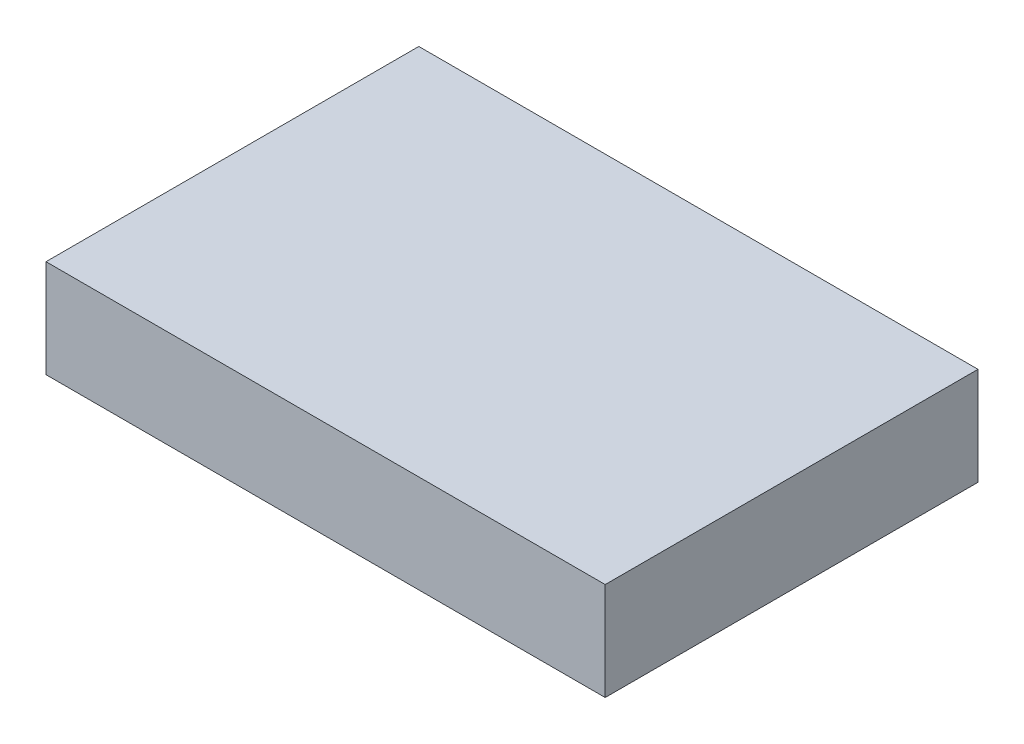
ISO-10303-21;
HEADER;
FILE_DESCRIPTION(('STEP AP214'),'2;1');
FILE_NAME('part.step','',(''),(''),'','','');
FILE_SCHEMA(('AUTOMOTIVE_DESIGN { 1 0 10303 214 1 1 1 1 }'));
ENDSEC;
DATA;
#1=APPLICATION_CONTEXT('core data for automotive mechanical design processes');
#2=APPLICATION_PROTOCOL_DEFINITION('international standard','automotive_design',2000,#1);
#3=PRODUCT_CONTEXT('',#1,'mechanical');
#4=PRODUCT('Part','Part','',(#3));
#5=PRODUCT_RELATED_PRODUCT_CATEGORY('part','',(#4));
#6=PRODUCT_DEFINITION_FORMATION('','',#4);
#7=PRODUCT_DEFINITION_CONTEXT('part definition',#1,'design');
#8=PRODUCT_DEFINITION('design','',#6,#7);
#9=PRODUCT_DEFINITION_SHAPE('','',#8);
#10=(LENGTH_UNIT() NAMED_UNIT(*) SI_UNIT(.MILLI.,.METRE.));
#11=(NAMED_UNIT(*) PLANE_ANGLE_UNIT() SI_UNIT($,.RADIAN.));
#12=(NAMED_UNIT(*) SI_UNIT($,.STERADIAN.) SOLID_ANGLE_UNIT());
#13=UNCERTAINTY_MEASURE_WITH_UNIT(LENGTH_MEASURE(1.E-05),#10,'distance_accuracy_value','');
#14=(GEOMETRIC_REPRESENTATION_CONTEXT(3) GLOBAL_UNCERTAINTY_ASSIGNED_CONTEXT((#13)) GLOBAL_UNIT_ASSIGNED_CONTEXT((#10,
#11,#12)) REPRESENTATION_CONTEXT('',''));
#15=CARTESIAN_POINT('',(0.,0.,0.));
#16=DIRECTION('',(0.,0.,1.));
#17=DIRECTION('',(1.,0.,0.));
#18=AXIS2_PLACEMENT_3D('',#15,#16,#17);
#19=CARTESIAN_POINT('',(-3.,1.05,-2.));
#20=DIRECTION('',(1.,0.,0.));
#21=DIRECTION('',(0.,0.,-1.));
#22=AXIS2_PLACEMENT_3D('',#19,#20,#21);
#23=PLANE('',#22);
#24=DIRECTION('',(0.,0.,1.));
#25=VECTOR('',#24,1.);
#26=CARTESIAN_POINT('',(-3.,0.,-2.));
#27=LINE('',#26,#25);
#28=CARTESIAN_POINT('',(-3.,0.,-2.));
#29=VERTEX_POINT('',#28);
#30=CARTESIAN_POINT('',(-3.,0.,2.));
#31=VERTEX_POINT('',#30);
#32=EDGE_CURVE('E96',#29,#31,#27,.T.);
#33=ORIENTED_EDGE('',*,*,#32,.T.);
#34=DIRECTION('',(0.,-1.,0.));
#35=VECTOR('',#34,1.);
#36=CARTESIAN_POINT('',(-3.,1.05,2.));
#37=LINE('',#36,#35);
#38=CARTESIAN_POINT('',(-3.,1.05,2.));
#39=VERTEX_POINT('',#38);
#40=EDGE_CURVE('E11',#39,#31,#37,.T.);
#41=ORIENTED_EDGE('',*,*,#40,.F.);
#42=DIRECTION('',(0.,0.,1.));
#43=VECTOR('',#42,1.);
#44=CARTESIAN_POINT('',(-3.,1.05,-2.));
#45=LINE('',#44,#43);
#46=CARTESIAN_POINT('',(-3.,1.05,-2.));
#47=VERTEX_POINT('',#46);
#48=EDGE_CURVE('E84',#47,#39,#45,.T.);
#49=ORIENTED_EDGE('',*,*,#48,.F.);
#50=DIRECTION('',(0.,-1.,0.));
#51=VECTOR('',#50,1.);
#52=CARTESIAN_POINT('',(-3.,1.05,-2.));
#53=LINE('',#52,#51);
#54=EDGE_CURVE('E92',#47,#29,#53,.T.);
#55=ORIENTED_EDGE('',*,*,#54,.T.);
#56=EDGE_LOOP('',(#33,#41,#49,#55));
#57=FACE_BOUND('',#56,.T.);
#58=ADVANCED_FACE('F33',(#57),#23,.F.);
#59=CARTESIAN_POINT('',(3.,1.05,2.));
#60=DIRECTION('',(0.,0.,-1.));
#61=DIRECTION('',(-1.,0.,0.));
#62=AXIS2_PLACEMENT_3D('',#59,#60,#61);
#63=PLANE('',#62);
#64=DIRECTION('',(1.,0.,0.));
#65=VECTOR('',#64,1.);
#66=CARTESIAN_POINT('',(3.,0.,2.));
#67=LINE('',#66,#65);
#68=CARTESIAN_POINT('',(3.,0.,2.));
#69=VERTEX_POINT('',#68);
#70=EDGE_CURVE('E88',#31,#69,#67,.T.);
#71=ORIENTED_EDGE('',*,*,#70,.T.);
#72=DIRECTION('',(0.,-1.,0.));
#73=VECTOR('',#72,1.);
#74=CARTESIAN_POINT('',(3.,1.05,2.));
#75=LINE('',#74,#73);
#76=CARTESIAN_POINT('',(3.,1.05,2.));
#77=VERTEX_POINT('',#76);
#78=EDGE_CURVE('E41',#77,#69,#75,.T.);
#79=ORIENTED_EDGE('',*,*,#78,.F.);
#80=DIRECTION('',(1.,0.,0.));
#81=VECTOR('',#80,1.);
#82=CARTESIAN_POINT('',(3.,1.05,2.));
#83=LINE('',#82,#81);
#84=EDGE_CURVE('E79',#39,#77,#83,.T.);
#85=ORIENTED_EDGE('',*,*,#84,.F.);
#86=ORIENTED_EDGE('',*,*,#40,.T.);
#87=EDGE_LOOP('',(#71,#79,#85,#86));
#88=FACE_BOUND('',#87,.T.);
#89=ADVANCED_FACE('F87',(#88),#63,.F.);
#90=CARTESIAN_POINT('',(3.,1.05,-2.));
#91=DIRECTION('',(-1.,0.,0.));
#92=DIRECTION('',(0.,0.,1.));
#93=AXIS2_PLACEMENT_3D('',#90,#91,#92);
#94=PLANE('',#93);
#95=DIRECTION('',(0.,0.,-1.));
#96=VECTOR('',#95,1.);
#97=CARTESIAN_POINT('',(3.,0.,-2.));
#98=LINE('',#97,#96);
#99=CARTESIAN_POINT('',(3.,0.,-2.));
#100=VERTEX_POINT('',#99);
#101=EDGE_CURVE('E66',#69,#100,#98,.T.);
#102=ORIENTED_EDGE('',*,*,#101,.T.);
#103=DIRECTION('',(0.,-1.,0.));
#104=VECTOR('',#103,1.);
#105=CARTESIAN_POINT('',(3.,1.05,-2.));
#106=LINE('',#105,#104);
#107=CARTESIAN_POINT('',(3.,1.05,-2.));
#108=VERTEX_POINT('',#107);
#109=EDGE_CURVE('E89',#108,#100,#106,.T.);
#110=ORIENTED_EDGE('',*,*,#109,.F.);
#111=DIRECTION('',(0.,0.,-1.));
#112=VECTOR('',#111,1.);
#113=CARTESIAN_POINT('',(3.,1.05,-2.));
#114=LINE('',#113,#112);
#115=EDGE_CURVE('E82',#77,#108,#114,.T.);
#116=ORIENTED_EDGE('',*,*,#115,.F.);
#117=ORIENTED_EDGE('',*,*,#78,.T.);
#118=EDGE_LOOP('',(#102,#110,#116,#117));
#119=FACE_BOUND('',#118,.T.);
#120=ADVANCED_FACE('F90',(#119),#94,.F.);
#121=CARTESIAN_POINT('',(3.,1.05,-2.));
#122=DIRECTION('',(0.,0.,1.));
#123=DIRECTION('',(1.,0.,0.));
#124=AXIS2_PLACEMENT_3D('',#121,#122,#123);
#125=PLANE('',#124);
#126=DIRECTION('',(-1.,0.,0.));
#127=VECTOR('',#126,1.);
#128=CARTESIAN_POINT('',(3.,0.,-2.));
#129=LINE('',#128,#127);
#130=EDGE_CURVE('E72',#100,#29,#129,.T.);
#131=ORIENTED_EDGE('',*,*,#130,.T.);
#132=ORIENTED_EDGE('',*,*,#54,.F.);
#133=DIRECTION('',(-1.,0.,0.));
#134=VECTOR('',#133,1.);
#135=CARTESIAN_POINT('',(3.,1.05,-2.));
#136=LINE('',#135,#134);
#137=EDGE_CURVE('E49',#108,#47,#136,.T.);
#138=ORIENTED_EDGE('',*,*,#137,.F.);
#139=ORIENTED_EDGE('',*,*,#109,.T.);
#140=EDGE_LOOP('',(#131,#132,#138,#139));
#141=FACE_BOUND('',#140,.T.);
#142=ADVANCED_FACE('F103',(#141),#125,.F.);
#143=CARTESIAN_POINT('',(0.,1.05,0.));
#144=DIRECTION('',(0.,-1.,0.));
#145=DIRECTION('',(0.,0.,-1.));
#146=AXIS2_PLACEMENT_3D('',#143,#144,#145);
#147=PLANE('',#146);
#148=ORIENTED_EDGE('',*,*,#48,.T.);
#149=ORIENTED_EDGE('',*,*,#84,.T.);
#150=ORIENTED_EDGE('',*,*,#115,.T.);
#151=ORIENTED_EDGE('',*,*,#137,.T.);
#152=EDGE_LOOP('',(#148,#149,#150,#151));
#153=FACE_BOUND('',#152,.T.);
#154=ADVANCED_FACE('F80',(#153),#147,.F.);
#155=CARTESIAN_POINT('',(0.,0.,0.));
#156=DIRECTION('',(0.,-1.,0.));
#157=DIRECTION('',(0.,0.,-1.));
#158=AXIS2_PLACEMENT_3D('',#155,#156,#157);
#159=PLANE('',#158);
#160=ORIENTED_EDGE('',*,*,#32,.F.);
#161=ORIENTED_EDGE('',*,*,#130,.F.);
#162=ORIENTED_EDGE('',*,*,#101,.F.);
#163=ORIENTED_EDGE('',*,*,#70,.F.);
#164=EDGE_LOOP('',(#160,#161,#162,#163));
#165=FACE_BOUND('',#164,.T.);
#166=ADVANCED_FACE('F106',(#165),#159,.T.);
#167=CLOSED_SHELL('',(#58,#89,#120,#142,#154,#166));
#168=MANIFOLD_SOLID_BREP('B2',#167);
#169=ADVANCED_BREP_SHAPE_REPRESENTATION('',(#18,#168),#14);
#170=SHAPE_DEFINITION_REPRESENTATION(#9,#169);
ENDSEC;
END-ISO-10303-21;
